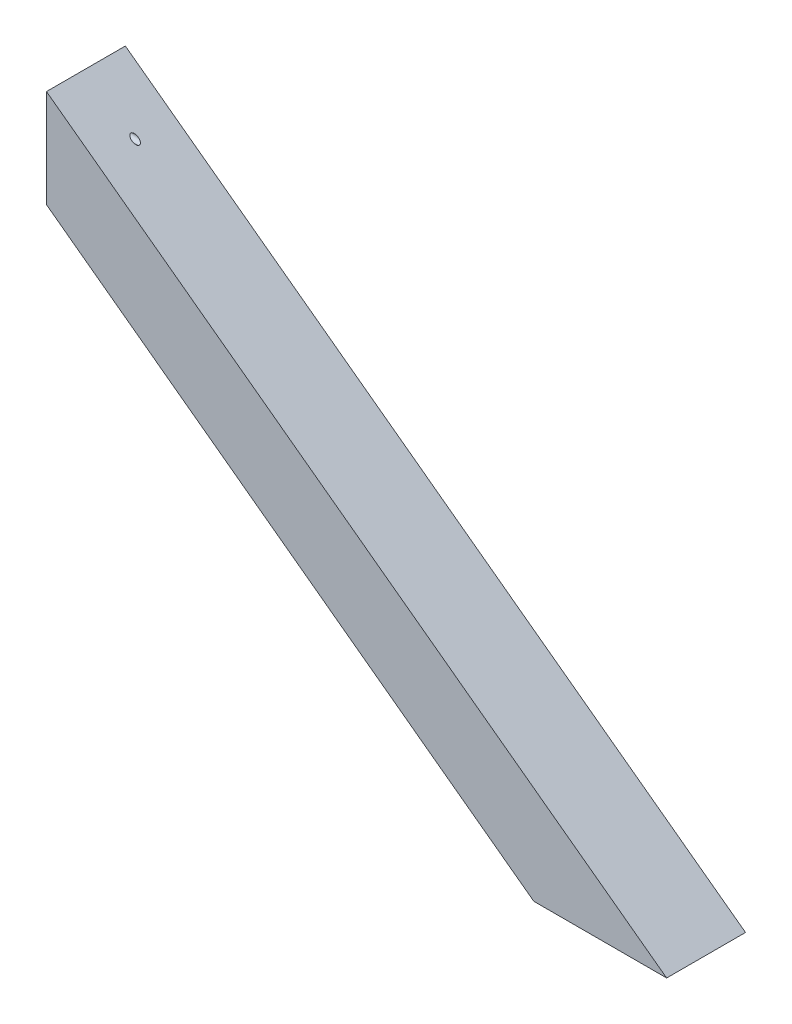
ISO-10303-21;
HEADER;
FILE_DESCRIPTION(('STEP AP214'),'2;1');
FILE_NAME('part.step','',(''),(''),'','','');
FILE_SCHEMA(('AUTOMOTIVE_DESIGN { 1 0 10303 214 1 1 1 1 }'));
ENDSEC;
DATA;
#1=APPLICATION_CONTEXT('core data for automotive mechanical design processes');
#2=APPLICATION_PROTOCOL_DEFINITION('international standard','automotive_design',2000,#1);
#3=PRODUCT_CONTEXT('',#1,'mechanical');
#4=PRODUCT('Part','Part','',(#3));
#5=PRODUCT_RELATED_PRODUCT_CATEGORY('part','',(#4));
#6=PRODUCT_DEFINITION_FORMATION('','',#4);
#7=PRODUCT_DEFINITION_CONTEXT('part definition',#1,'design');
#8=PRODUCT_DEFINITION('design','',#6,#7);
#9=PRODUCT_DEFINITION_SHAPE('','',#8);
#10=(LENGTH_UNIT() NAMED_UNIT(*) SI_UNIT(.MILLI.,.METRE.));
#11=(NAMED_UNIT(*) PLANE_ANGLE_UNIT() SI_UNIT($,.RADIAN.));
#12=(NAMED_UNIT(*) SI_UNIT($,.STERADIAN.) SOLID_ANGLE_UNIT());
#13=UNCERTAINTY_MEASURE_WITH_UNIT(LENGTH_MEASURE(1.E-05),#10,'distance_accuracy_value','');
#14=(GEOMETRIC_REPRESENTATION_CONTEXT(3) GLOBAL_UNCERTAINTY_ASSIGNED_CONTEXT((#13)) GLOBAL_UNIT_ASSIGNED_CONTEXT((#10,
#11,#12)) REPRESENTATION_CONTEXT('',''));
#15=CARTESIAN_POINT('',(0.,0.,0.));
#16=DIRECTION('',(0.,0.,1.));
#17=DIRECTION('',(1.,0.,0.));
#18=AXIS2_PLACEMENT_3D('',#15,#16,#17);
#19=CARTESIAN_POINT('',(248.390827109976,-140.091646172514,44.));
#20=DIRECTION('',(-0.5937478473389,-0.804651162790698,0.));
#21=DIRECTION('',(0.804651162790698,-0.5937478473389,0.));
#22=AXIS2_PLACEMENT_3D('',#19,#20,#21);
#23=PLANE('',#22);
#24=CARTESIAN_POINT('',(-70.1662337374194,94.9699281832133,22.));
#25=DIRECTION('',(-0.5937478473389,-0.804651162790698,0.));
#26=DIRECTION('',(-0.804651162790698,0.5937478473389,0.));
#27=AXIS2_PLACEMENT_3D('',#24,#25,#26);
#28=ELLIPSE('',#27,2.94737910687722,1.75);
#29=CARTESIAN_POINT('',(-72.5378457629532,96.7199281832133,22.));
#30=VERTEX_POINT('',#29);
#31=EDGE_CURVE('E118',#30,#30,#28,.F.);
#32=ORIENTED_EDGE('',*,*,#31,.F.);
#33=EDGE_LOOP('',(#32));
#34=FACE_BOUND('',#33,.T.);
#35=DIRECTION('',(-0.804651162790698,0.5937478473389,0.));
#36=VECTOR('',#35,1.);
#37=CARTESIAN_POINT('',(248.390827109976,-140.091646172514,0.));
#38=LINE('',#37,#36);
#39=CARTESIAN_POINT('',(248.390827109976,-140.091646172514,0.));
#40=VERTEX_POINT('',#39);
#41=CARTESIAN_POINT('',(-97.6091728900244,115.219928183213,0.));
#42=VERTEX_POINT('',#41);
#43=EDGE_CURVE('E114',#40,#42,#38,.T.);
#44=ORIENTED_EDGE('',*,*,#43,.T.);
#45=DIRECTION('',(0.,0.,-1.));
#46=VECTOR('',#45,1.);
#47=CARTESIAN_POINT('',(-97.6091728900244,115.219928183213,44.));
#48=LINE('',#47,#46);
#49=CARTESIAN_POINT('',(-97.6091728900244,115.219928183213,44.));
#50=VERTEX_POINT('',#49);
#51=EDGE_CURVE('E11',#50,#42,#48,.T.);
#52=ORIENTED_EDGE('',*,*,#51,.F.);
#53=DIRECTION('',(-0.804651162790698,0.5937478473389,0.));
#54=VECTOR('',#53,1.);
#55=CARTESIAN_POINT('',(248.390827109976,-140.091646172514,44.));
#56=LINE('',#55,#54);
#57=CARTESIAN_POINT('',(248.390827109976,-140.091646172514,44.));
#58=VERTEX_POINT('',#57);
#59=EDGE_CURVE('E97',#58,#50,#56,.T.);
#60=ORIENTED_EDGE('',*,*,#59,.F.);
#61=DIRECTION('',(0.,0.,-1.));
#62=VECTOR('',#61,1.);
#63=CARTESIAN_POINT('',(248.390827109976,-140.091646172514,44.));
#64=LINE('',#63,#62);
#65=EDGE_CURVE('E110',#58,#40,#64,.T.);
#66=ORIENTED_EDGE('',*,*,#65,.T.);
#67=EDGE_LOOP('',(#44,#52,#60,#66));
#68=FACE_BOUND('',#67,.T.);
#69=ADVANCED_FACE('F45',(#34,#68),#23,.F.);
#70=CARTESIAN_POINT('',(-97.6091728900244,115.219928183213,44.));
#71=DIRECTION('',(1.,0.,0.));
#72=DIRECTION('',(0.,0.,-1.));
#73=AXIS2_PLACEMENT_3D('',#70,#71,#72);
#74=PLANE('',#73);
#75=CARTESIAN_POINT('',(-97.6091728900244,94.9699281832133,22.));
#76=DIRECTION('',(-1.,0.,0.));
#77=DIRECTION('',(0.,0.,1.));
#78=AXIS2_PLACEMENT_3D('',#75,#76,#77);
#79=CIRCLE('',#78,1.75);
#80=CARTESIAN_POINT('',(-97.6091728900244,94.9699281832133,23.75));
#81=VERTEX_POINT('',#80);
#82=EDGE_CURVE('E140',#81,#81,#79,.T.);
#83=ORIENTED_EDGE('',*,*,#82,.F.);
#84=EDGE_LOOP('',(#83));
#85=FACE_BOUND('',#84,.T.);
#86=DIRECTION('',(0.,-1.,0.));
#87=VECTOR('',#86,1.);
#88=CARTESIAN_POINT('',(-97.6091728900244,115.219928183213,0.));
#89=LINE('',#88,#87);
#90=CARTESIAN_POINT('',(-97.6091728900244,60.5378472583578,0.));
#91=VERTEX_POINT('',#90);
#92=EDGE_CURVE('E102',#42,#91,#89,.T.);
#93=ORIENTED_EDGE('',*,*,#92,.T.);
#94=DIRECTION('',(0.,0.,-1.));
#95=VECTOR('',#94,1.);
#96=CARTESIAN_POINT('',(-97.6091728900244,60.5378472583578,44.));
#97=LINE('',#96,#95);
#98=CARTESIAN_POINT('',(-97.6091728900244,60.5378472583578,44.));
#99=VERTEX_POINT('',#98);
#100=EDGE_CURVE('E54',#99,#91,#97,.T.);
#101=ORIENTED_EDGE('',*,*,#100,.F.);
#102=DIRECTION('',(0.,-1.,0.));
#103=VECTOR('',#102,1.);
#104=CARTESIAN_POINT('',(-97.6091728900244,115.219928183213,44.));
#105=LINE('',#104,#103);
#106=EDGE_CURVE('E92',#50,#99,#105,.T.);
#107=ORIENTED_EDGE('',*,*,#106,.F.);
#108=ORIENTED_EDGE('',*,*,#51,.T.);
#109=EDGE_LOOP('',(#93,#101,#107,#108));
#110=FACE_BOUND('',#109,.T.);
#111=ADVANCED_FACE('F101',(#85,#110),#74,.F.);
#112=CARTESIAN_POINT('',(174.28529527992,-140.091646172514,44.));
#113=DIRECTION('',(0.5937478473389,0.804651162790698,0.));
#114=DIRECTION('',(-0.804651162790698,0.5937478473389,0.));
#115=AXIS2_PLACEMENT_3D('',#112,#113,#114);
#116=PLANE('',#115);
#117=DIRECTION('',(0.804651162790698,-0.5937478473389,0.));
#118=VECTOR('',#117,1.);
#119=CARTESIAN_POINT('',(174.28529527992,-140.091646172514,0.));
#120=LINE('',#119,#118);
#121=CARTESIAN_POINT('',(174.28529527992,-140.091646172514,0.));
#122=VERTEX_POINT('',#121);
#123=EDGE_CURVE('E79',#91,#122,#120,.T.);
#124=ORIENTED_EDGE('',*,*,#123,.T.);
#125=DIRECTION('',(0.,0.,-1.));
#126=VECTOR('',#125,1.);
#127=CARTESIAN_POINT('',(174.28529527992,-140.091646172514,44.));
#128=LINE('',#127,#126);
#129=CARTESIAN_POINT('',(174.28529527992,-140.091646172514,44.));
#130=VERTEX_POINT('',#129);
#131=EDGE_CURVE('E104',#130,#122,#128,.T.);
#132=ORIENTED_EDGE('',*,*,#131,.F.);
#133=DIRECTION('',(0.804651162790698,-0.5937478473389,0.));
#134=VECTOR('',#133,1.);
#135=CARTESIAN_POINT('',(174.28529527992,-140.091646172514,44.));
#136=LINE('',#135,#134);
#137=EDGE_CURVE('E95',#99,#130,#136,.T.);
#138=ORIENTED_EDGE('',*,*,#137,.F.);
#139=ORIENTED_EDGE('',*,*,#100,.T.);
#140=EDGE_LOOP('',(#124,#132,#138,#139));
#141=FACE_BOUND('',#140,.T.);
#142=ADVANCED_FACE('F105',(#141),#116,.F.);
#143=CARTESIAN_POINT('',(248.390827109976,-140.091646172514,44.));
#144=DIRECTION('',(0.,1.,0.));
#145=DIRECTION('',(0.,0.,1.));
#146=AXIS2_PLACEMENT_3D('',#143,#144,#145);
#147=PLANE('',#146);
#148=DIRECTION('',(1.,0.,0.));
#149=VECTOR('',#148,1.);
#150=CARTESIAN_POINT('',(248.390827109976,-140.091646172514,0.));
#151=LINE('',#150,#149);
#152=EDGE_CURVE('E85',#122,#40,#151,.T.);
#153=ORIENTED_EDGE('',*,*,#152,.T.);
#154=ORIENTED_EDGE('',*,*,#65,.F.);
#155=DIRECTION('',(1.,0.,0.));
#156=VECTOR('',#155,1.);
#157=CARTESIAN_POINT('',(248.390827109976,-140.091646172514,44.));
#158=LINE('',#157,#156);
#159=EDGE_CURVE('E62',#130,#58,#158,.T.);
#160=ORIENTED_EDGE('',*,*,#159,.F.);
#161=ORIENTED_EDGE('',*,*,#131,.T.);
#162=EDGE_LOOP('',(#153,#154,#160,#161));
#163=FACE_BOUND('',#162,.T.);
#164=ADVANCED_FACE('F129',(#163),#147,.F.);
#165=CARTESIAN_POINT('',(0.,0.,44.));
#166=DIRECTION('',(0.,0.,1.));
#167=DIRECTION('',(1.,0.,0.));
#168=AXIS2_PLACEMENT_3D('',#165,#166,#167);
#169=PLANE('',#168);
#170=ORIENTED_EDGE('',*,*,#59,.T.);
#171=ORIENTED_EDGE('',*,*,#106,.T.);
#172=ORIENTED_EDGE('',*,*,#137,.T.);
#173=ORIENTED_EDGE('',*,*,#159,.T.);
#174=EDGE_LOOP('',(#170,#171,#172,#173));
#175=FACE_BOUND('',#174,.T.);
#176=ADVANCED_FACE('F93',(#175),#169,.T.);
#177=CARTESIAN_POINT('',(0.,0.,0.));
#178=DIRECTION('',(0.,0.,1.));
#179=DIRECTION('',(1.,0.,0.));
#180=AXIS2_PLACEMENT_3D('',#177,#178,#179);
#181=PLANE('',#180);
#182=ORIENTED_EDGE('',*,*,#43,.F.);
#183=ORIENTED_EDGE('',*,*,#152,.F.);
#184=ORIENTED_EDGE('',*,*,#123,.F.);
#185=ORIENTED_EDGE('',*,*,#92,.F.);
#186=EDGE_LOOP('',(#182,#183,#184,#185));
#187=FACE_BOUND('',#186,.T.);
#188=ADVANCED_FACE('F132',(#187),#181,.F.);
#189=CARTESIAN_POINT('',(-63.5231364968657,94.9699281832133,22.));
#190=DIRECTION('',(-1.,0.,0.));
#191=DIRECTION('',(0.,0.,1.));
#192=AXIS2_PLACEMENT_3D('',#189,#190,#191);
#193=CYLINDRICAL_SURFACE('',#192,1.75);
#194=ORIENTED_EDGE('',*,*,#31,.T.);
#195=EDGE_LOOP('',(#194));
#196=FACE_BOUND('',#195,.T.);
#197=ORIENTED_EDGE('',*,*,#82,.T.);
#198=EDGE_LOOP('',(#197));
#199=FACE_BOUND('',#198,.T.);
#200=ADVANCED_FACE('F146',(#196,#199),#193,.F.);
#201=CLOSED_SHELL('',(#69,#111,#142,#164,#176,#188,#200));
#202=MANIFOLD_SOLID_BREP('B2',#201);
#203=ADVANCED_BREP_SHAPE_REPRESENTATION('',(#18,#202),#14);
#204=SHAPE_DEFINITION_REPRESENTATION(#9,#203);
ENDSEC;
END-ISO-10303-21;
